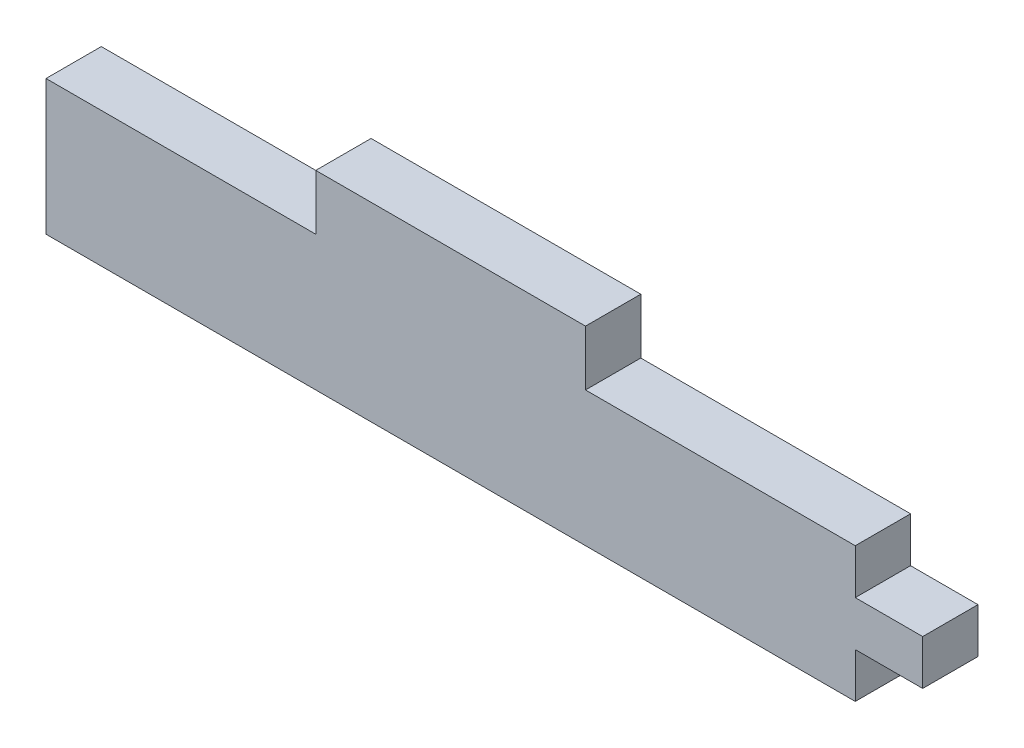
ISO-10303-21;
HEADER;
FILE_DESCRIPTION(('STEP AP214'),'2;1');
FILE_NAME('part.step','',(''),(''),'','','');
FILE_SCHEMA(('AUTOMOTIVE_DESIGN { 1 0 10303 214 1 1 1 1 }'));
ENDSEC;
DATA;
#1=APPLICATION_CONTEXT('core data for automotive mechanical design processes');
#2=APPLICATION_PROTOCOL_DEFINITION('international standard','automotive_design',2000,#1);
#3=PRODUCT_CONTEXT('',#1,'mechanical');
#4=PRODUCT('Part','Part','',(#3));
#5=PRODUCT_RELATED_PRODUCT_CATEGORY('part','',(#4));
#6=PRODUCT_DEFINITION_FORMATION('','',#4);
#7=PRODUCT_DEFINITION_CONTEXT('part definition',#1,'design');
#8=PRODUCT_DEFINITION('design','',#6,#7);
#9=PRODUCT_DEFINITION_SHAPE('','',#8);
#10=(LENGTH_UNIT() NAMED_UNIT(*) SI_UNIT(.MILLI.,.METRE.));
#11=(NAMED_UNIT(*) PLANE_ANGLE_UNIT() SI_UNIT($,.RADIAN.));
#12=(NAMED_UNIT(*) SI_UNIT($,.STERADIAN.) SOLID_ANGLE_UNIT());
#13=UNCERTAINTY_MEASURE_WITH_UNIT(LENGTH_MEASURE(1.E-05),#10,'distance_accuracy_value','');
#14=(GEOMETRIC_REPRESENTATION_CONTEXT(3) GLOBAL_UNCERTAINTY_ASSIGNED_CONTEXT((#13)) GLOBAL_UNIT_ASSIGNED_CONTEXT((#10,
#11,#12)) REPRESENTATION_CONTEXT('',''));
#15=CARTESIAN_POINT('',(0.,0.,0.));
#16=DIRECTION('',(0.,0.,1.));
#17=DIRECTION('',(1.,0.,0.));
#18=AXIS2_PLACEMENT_3D('',#15,#16,#17);
#19=CARTESIAN_POINT('',(25.4,12.7,5.207));
#20=DIRECTION('',(-1.,0.,0.));
#21=DIRECTION('',(0.,-1.,0.));
#22=AXIS2_PLACEMENT_3D('',#19,#20,#21);
#23=PLANE('',#22);
#24=DIRECTION('',(0.,1.,0.));
#25=VECTOR('',#24,1.);
#26=CARTESIAN_POINT('',(25.4,12.7,0.));
#27=LINE('',#26,#25);
#28=CARTESIAN_POINT('',(25.4,12.7,0.));
#29=VERTEX_POINT('',#28);
#30=CARTESIAN_POINT('',(25.4,17.907,0.));
#31=VERTEX_POINT('',#30);
#32=EDGE_CURVE('E153',#29,#31,#27,.T.);
#33=ORIENTED_EDGE('',*,*,#32,.F.);
#34=DIRECTION('',(0.,0.,-1.));
#35=VECTOR('',#34,1.);
#36=CARTESIAN_POINT('',(25.4,12.7,5.207));
#37=LINE('',#36,#35);
#38=CARTESIAN_POINT('',(25.4,12.7,5.207));
#39=VERTEX_POINT('',#38);
#40=EDGE_CURVE('E11',#39,#29,#37,.T.);
#41=ORIENTED_EDGE('',*,*,#40,.F.);
#42=DIRECTION('',(0.,1.,0.));
#43=VECTOR('',#42,1.);
#44=CARTESIAN_POINT('',(25.4,12.7,5.207));
#45=LINE('',#44,#43);
#46=CARTESIAN_POINT('',(25.4,17.907,5.207));
#47=VERTEX_POINT('',#46);
#48=EDGE_CURVE('E184',#39,#47,#45,.T.);
#49=ORIENTED_EDGE('',*,*,#48,.T.);
#50=DIRECTION('',(0.,0.,-1.));
#51=VECTOR('',#50,1.);
#52=CARTESIAN_POINT('',(25.4,17.907,5.207));
#53=LINE('',#52,#51);
#54=EDGE_CURVE('E38',#47,#31,#53,.T.);
#55=ORIENTED_EDGE('',*,*,#54,.T.);
#56=EDGE_LOOP('',(#33,#41,#49,#55));
#57=FACE_BOUND('',#56,.T.);
#58=ADVANCED_FACE('F35',(#57),#23,.T.);
#59=CARTESIAN_POINT('',(0.,12.7,5.207));
#60=DIRECTION('',(0.,1.,0.));
#61=DIRECTION('',(0.,0.,1.));
#62=AXIS2_PLACEMENT_3D('',#59,#60,#61);
#63=PLANE('',#62);
#64=DIRECTION('',(1.,0.,0.));
#65=VECTOR('',#64,1.);
#66=CARTESIAN_POINT('',(0.,12.7,0.));
#67=LINE('',#66,#65);
#68=CARTESIAN_POINT('',(0.,12.7,0.));
#69=VERTEX_POINT('',#68);
#70=EDGE_CURVE('E182',#69,#29,#67,.T.);
#71=ORIENTED_EDGE('',*,*,#70,.F.);
#72=DIRECTION('',(0.,0.,-1.));
#73=VECTOR('',#72,1.);
#74=CARTESIAN_POINT('',(0.,12.7,5.207));
#75=LINE('',#74,#73);
#76=CARTESIAN_POINT('',(0.,12.7,5.207));
#77=VERTEX_POINT('',#76);
#78=EDGE_CURVE('E44',#77,#69,#75,.T.);
#79=ORIENTED_EDGE('',*,*,#78,.F.);
#80=DIRECTION('',(1.,0.,0.));
#81=VECTOR('',#80,1.);
#82=CARTESIAN_POINT('',(0.,12.7,5.207));
#83=LINE('',#82,#81);
#84=EDGE_CURVE('E148',#77,#39,#83,.T.);
#85=ORIENTED_EDGE('',*,*,#84,.T.);
#86=ORIENTED_EDGE('',*,*,#40,.T.);
#87=EDGE_LOOP('',(#71,#79,#85,#86));
#88=FACE_BOUND('',#87,.T.);
#89=ADVANCED_FACE('F206',(#88),#63,.T.);
#90=CARTESIAN_POINT('',(0.,0.,5.207));
#91=DIRECTION('',(-1.,0.,0.));
#92=DIRECTION('',(0.,0.,1.));
#93=AXIS2_PLACEMENT_3D('',#90,#91,#92);
#94=PLANE('',#93);
#95=DIRECTION('',(0.,1.,0.));
#96=VECTOR('',#95,1.);
#97=CARTESIAN_POINT('',(0.,0.,0.));
#98=LINE('',#97,#96);
#99=CARTESIAN_POINT('',(0.,0.,0.));
#100=VERTEX_POINT('',#99);
#101=EDGE_CURVE('E134',#100,#69,#98,.T.);
#102=ORIENTED_EDGE('',*,*,#101,.F.);
#103=DIRECTION('',(0.,0.,-1.));
#104=VECTOR('',#103,1.);
#105=CARTESIAN_POINT('',(0.,0.,5.207));
#106=LINE('',#105,#104);
#107=CARTESIAN_POINT('',(0.,0.,5.207));
#108=VERTEX_POINT('',#107);
#109=EDGE_CURVE('E128',#108,#100,#106,.T.);
#110=ORIENTED_EDGE('',*,*,#109,.F.);
#111=DIRECTION('',(0.,1.,0.));
#112=VECTOR('',#111,1.);
#113=CARTESIAN_POINT('',(0.,0.,5.207));
#114=LINE('',#113,#112);
#115=EDGE_CURVE('E132',#108,#77,#114,.T.);
#116=ORIENTED_EDGE('',*,*,#115,.T.);
#117=ORIENTED_EDGE('',*,*,#78,.T.);
#118=EDGE_LOOP('',(#102,#110,#116,#117));
#119=FACE_BOUND('',#118,.T.);
#120=ADVANCED_FACE('F130',(#119),#94,.T.);
#121=CARTESIAN_POINT('',(0.,0.,5.207));
#122=DIRECTION('',(0.,1.,0.));
#123=DIRECTION('',(0.,0.,1.));
#124=AXIS2_PLACEMENT_3D('',#121,#122,#123);
#125=PLANE('',#124);
#126=DIRECTION('',(1.,0.,0.));
#127=VECTOR('',#126,1.);
#128=CARTESIAN_POINT('',(0.,0.,0.));
#129=LINE('',#128,#127);
#130=CARTESIAN_POINT('',(76.2,0.,0.));
#131=VERTEX_POINT('',#130);
#132=EDGE_CURVE('E179',#100,#131,#129,.T.);
#133=ORIENTED_EDGE('',*,*,#132,.T.);
#134=DIRECTION('',(0.,0.,-1.));
#135=VECTOR('',#134,1.);
#136=CARTESIAN_POINT('',(76.2,0.,5.207));
#137=LINE('',#136,#135);
#138=CARTESIAN_POINT('',(76.2,0.,5.207));
#139=VERTEX_POINT('',#138);
#140=EDGE_CURVE('E137',#139,#131,#137,.T.);
#141=ORIENTED_EDGE('',*,*,#140,.F.);
#142=DIRECTION('',(1.,0.,0.));
#143=VECTOR('',#142,1.);
#144=CARTESIAN_POINT('',(0.,0.,5.207));
#145=LINE('',#144,#143);
#146=EDGE_CURVE('E140',#108,#139,#145,.T.);
#147=ORIENTED_EDGE('',*,*,#146,.F.);
#148=ORIENTED_EDGE('',*,*,#109,.T.);
#149=EDGE_LOOP('',(#133,#141,#147,#148));
#150=FACE_BOUND('',#149,.T.);
#151=ADVANCED_FACE('F141',(#150),#125,.F.);
#152=CARTESIAN_POINT('',(76.2,0.,5.207));
#153=DIRECTION('',(-1.,0.,0.));
#154=DIRECTION('',(0.,0.,1.));
#155=AXIS2_PLACEMENT_3D('',#152,#153,#154);
#156=PLANE('',#155);
#157=DIRECTION('',(0.,1.,0.));
#158=VECTOR('',#157,1.);
#159=CARTESIAN_POINT('',(76.2,0.,0.));
#160=LINE('',#159,#158);
#161=CARTESIAN_POINT('',(76.2,4.23333333333333,0.));
#162=VERTEX_POINT('',#161);
#163=EDGE_CURVE('E177',#131,#162,#160,.T.);
#164=ORIENTED_EDGE('',*,*,#163,.T.);
#165=DIRECTION('',(0.,0.,-1.));
#166=VECTOR('',#165,1.);
#167=CARTESIAN_POINT('',(76.2,4.23333333333333,5.207));
#168=LINE('',#167,#166);
#169=CARTESIAN_POINT('',(76.2,4.23333333333333,5.207));
#170=VERTEX_POINT('',#169);
#171=EDGE_CURVE('E188',#170,#162,#168,.T.);
#172=ORIENTED_EDGE('',*,*,#171,.F.);
#173=DIRECTION('',(0.,1.,0.));
#174=VECTOR('',#173,1.);
#175=CARTESIAN_POINT('',(76.2,0.,5.207));
#176=LINE('',#175,#174);
#177=EDGE_CURVE('E145',#139,#170,#176,.T.);
#178=ORIENTED_EDGE('',*,*,#177,.F.);
#179=ORIENTED_EDGE('',*,*,#140,.T.);
#180=EDGE_LOOP('',(#164,#172,#178,#179));
#181=FACE_BOUND('',#180,.T.);
#182=ADVANCED_FACE('F219',(#181),#156,.F.);
#183=CARTESIAN_POINT('',(76.2,4.23333333333333,5.207));
#184=DIRECTION('',(0.,1.,0.));
#185=DIRECTION('',(-1.,0.,0.));
#186=AXIS2_PLACEMENT_3D('',#183,#184,#185);
#187=PLANE('',#186);
#188=DIRECTION('',(1.,0.,0.));
#189=VECTOR('',#188,1.);
#190=CARTESIAN_POINT('',(76.2,4.23333333333333,0.));
#191=LINE('',#190,#189);
#192=CARTESIAN_POINT('',(82.55,4.23333333333333,0.));
#193=VERTEX_POINT('',#192);
#194=EDGE_CURVE('E174',#162,#193,#191,.T.);
#195=ORIENTED_EDGE('',*,*,#194,.T.);
#196=DIRECTION('',(0.,0.,-1.));
#197=VECTOR('',#196,1.);
#198=CARTESIAN_POINT('',(82.55,4.23333333333333,5.207));
#199=LINE('',#198,#197);
#200=CARTESIAN_POINT('',(82.55,4.23333333333333,5.207));
#201=VERTEX_POINT('',#200);
#202=EDGE_CURVE('E191',#201,#193,#199,.T.);
#203=ORIENTED_EDGE('',*,*,#202,.F.);
#204=DIRECTION('',(1.,0.,0.));
#205=VECTOR('',#204,1.);
#206=CARTESIAN_POINT('',(76.2,4.23333333333333,5.207));
#207=LINE('',#206,#205);
#208=EDGE_CURVE('E351',#170,#201,#207,.T.);
#209=ORIENTED_EDGE('',*,*,#208,.F.);
#210=ORIENTED_EDGE('',*,*,#171,.T.);
#211=EDGE_LOOP('',(#195,#203,#209,#210));
#212=FACE_BOUND('',#211,.T.);
#213=ADVANCED_FACE('F222',(#212),#187,.F.);
#214=CARTESIAN_POINT('',(82.55,8.46666666666667,5.207));
#215=DIRECTION('',(1.,0.,0.));
#216=DIRECTION('',(0.,0.,-1.));
#217=AXIS2_PLACEMENT_3D('',#214,#215,#216);
#218=PLANE('',#217);
#219=DIRECTION('',(0.,-1.,0.));
#220=VECTOR('',#219,1.);
#221=CARTESIAN_POINT('',(82.55,8.46666666666667,0.));
#222=LINE('',#221,#220);
#223=CARTESIAN_POINT('',(82.55,8.46666666666667,0.));
#224=VERTEX_POINT('',#223);
#225=EDGE_CURVE('E171',#224,#193,#222,.T.);
#226=ORIENTED_EDGE('',*,*,#225,.F.);
#227=DIRECTION('',(0.,0.,-1.));
#228=VECTOR('',#227,1.);
#229=CARTESIAN_POINT('',(82.55,8.46666666666667,5.207));
#230=LINE('',#229,#228);
#231=CARTESIAN_POINT('',(82.55,8.46666666666667,5.207));
#232=VERTEX_POINT('',#231);
#233=EDGE_CURVE('E193',#232,#224,#230,.T.);
#234=ORIENTED_EDGE('',*,*,#233,.F.);
#235=DIRECTION('',(0.,-1.,0.));
#236=VECTOR('',#235,1.);
#237=CARTESIAN_POINT('',(82.55,8.46666666666667,5.207));
#238=LINE('',#237,#236);
#239=EDGE_CURVE('E352',#232,#201,#238,.T.);
#240=ORIENTED_EDGE('',*,*,#239,.T.);
#241=ORIENTED_EDGE('',*,*,#202,.T.);
#242=EDGE_LOOP('',(#226,#234,#240,#241));
#243=FACE_BOUND('',#242,.T.);
#244=ADVANCED_FACE('F226',(#243),#218,.T.);
#245=CARTESIAN_POINT('',(76.2,8.46666666666667,5.207));
#246=DIRECTION('',(0.,1.,0.));
#247=DIRECTION('',(-1.,0.,0.));
#248=AXIS2_PLACEMENT_3D('',#245,#246,#247);
#249=PLANE('',#248);
#250=DIRECTION('',(1.,0.,0.));
#251=VECTOR('',#250,1.);
#252=CARTESIAN_POINT('',(76.2,8.46666666666667,0.));
#253=LINE('',#252,#251);
#254=CARTESIAN_POINT('',(76.2,8.46666666666667,0.));
#255=VERTEX_POINT('',#254);
#256=EDGE_CURVE('E168',#255,#224,#253,.T.);
#257=ORIENTED_EDGE('',*,*,#256,.F.);
#258=DIRECTION('',(0.,0.,-1.));
#259=VECTOR('',#258,1.);
#260=CARTESIAN_POINT('',(76.2,8.46666666666667,5.207));
#261=LINE('',#260,#259);
#262=CARTESIAN_POINT('',(76.2,8.46666666666667,5.207));
#263=VERTEX_POINT('',#262);
#264=EDGE_CURVE('E195',#263,#255,#261,.T.);
#265=ORIENTED_EDGE('',*,*,#264,.F.);
#266=DIRECTION('',(1.,0.,0.));
#267=VECTOR('',#266,1.);
#268=CARTESIAN_POINT('',(76.2,8.46666666666667,5.207));
#269=LINE('',#268,#267);
#270=EDGE_CURVE('E343',#263,#232,#269,.T.);
#271=ORIENTED_EDGE('',*,*,#270,.T.);
#272=ORIENTED_EDGE('',*,*,#233,.T.);
#273=EDGE_LOOP('',(#257,#265,#271,#272));
#274=FACE_BOUND('',#273,.T.);
#275=ADVANCED_FACE('F230',(#274),#249,.T.);
#276=CARTESIAN_POINT('',(76.2,8.46666666666667,5.207));
#277=DIRECTION('',(-1.,0.,0.));
#278=DIRECTION('',(0.,0.,1.));
#279=AXIS2_PLACEMENT_3D('',#276,#277,#278);
#280=PLANE('',#279);
#281=DIRECTION('',(0.,1.,0.));
#282=VECTOR('',#281,1.);
#283=CARTESIAN_POINT('',(76.2,8.46666666666667,0.));
#284=LINE('',#283,#282);
#285=CARTESIAN_POINT('',(76.2,12.7,0.));
#286=VERTEX_POINT('',#285);
#287=EDGE_CURVE('E165',#255,#286,#284,.T.);
#288=ORIENTED_EDGE('',*,*,#287,.T.);
#289=DIRECTION('',(0.,0.,-1.));
#290=VECTOR('',#289,1.);
#291=CARTESIAN_POINT('',(76.2,12.7,5.207));
#292=LINE('',#291,#290);
#293=CARTESIAN_POINT('',(76.2,12.7,5.207));
#294=VERTEX_POINT('',#293);
#295=EDGE_CURVE('E197',#294,#286,#292,.T.);
#296=ORIENTED_EDGE('',*,*,#295,.F.);
#297=DIRECTION('',(0.,1.,0.));
#298=VECTOR('',#297,1.);
#299=CARTESIAN_POINT('',(76.2,8.46666666666667,5.207));
#300=LINE('',#299,#298);
#301=EDGE_CURVE('E357',#263,#294,#300,.T.);
#302=ORIENTED_EDGE('',*,*,#301,.F.);
#303=ORIENTED_EDGE('',*,*,#264,.T.);
#304=EDGE_LOOP('',(#288,#296,#302,#303));
#305=FACE_BOUND('',#304,.T.);
#306=ADVANCED_FACE('F234',(#305),#280,.F.);
#307=CARTESIAN_POINT('',(50.8,12.7,5.207));
#308=DIRECTION('',(0.,1.,0.));
#309=DIRECTION('',(0.,0.,1.));
#310=AXIS2_PLACEMENT_3D('',#307,#308,#309);
#311=PLANE('',#310);
#312=DIRECTION('',(1.,0.,0.));
#313=VECTOR('',#312,1.);
#314=CARTESIAN_POINT('',(50.8,12.7,0.));
#315=LINE('',#314,#313);
#316=CARTESIAN_POINT('',(50.8,12.7,0.));
#317=VERTEX_POINT('',#316);
#318=EDGE_CURVE('E162',#317,#286,#315,.T.);
#319=ORIENTED_EDGE('',*,*,#318,.F.);
#320=DIRECTION('',(0.,0.,-1.));
#321=VECTOR('',#320,1.);
#322=CARTESIAN_POINT('',(50.8,12.7,5.207));
#323=LINE('',#322,#321);
#324=CARTESIAN_POINT('',(50.8,12.7,5.207));
#325=VERTEX_POINT('',#324);
#326=EDGE_CURVE('E199',#325,#317,#323,.T.);
#327=ORIENTED_EDGE('',*,*,#326,.F.);
#328=DIRECTION('',(1.,0.,0.));
#329=VECTOR('',#328,1.);
#330=CARTESIAN_POINT('',(50.8,12.7,5.207));
#331=LINE('',#330,#329);
#332=EDGE_CURVE('E337',#325,#294,#331,.T.);
#333=ORIENTED_EDGE('',*,*,#332,.T.);
#334=ORIENTED_EDGE('',*,*,#295,.T.);
#335=EDGE_LOOP('',(#319,#327,#333,#334));
#336=FACE_BOUND('',#335,.T.);
#337=ADVANCED_FACE('F238',(#336),#311,.T.);
#338=CARTESIAN_POINT('',(50.8,12.7,5.207));
#339=DIRECTION('',(-1.,0.,0.));
#340=DIRECTION('',(0.,0.,1.));
#341=AXIS2_PLACEMENT_3D('',#338,#339,#340);
#342=PLANE('',#341);
#343=DIRECTION('',(0.,1.,0.));
#344=VECTOR('',#343,1.);
#345=CARTESIAN_POINT('',(50.8,12.7,0.));
#346=LINE('',#345,#344);
#347=CARTESIAN_POINT('',(50.8,17.907,0.));
#348=VERTEX_POINT('',#347);
#349=EDGE_CURVE('E159',#317,#348,#346,.T.);
#350=ORIENTED_EDGE('',*,*,#349,.T.);
#351=DIRECTION('',(0.,0.,-1.));
#352=VECTOR('',#351,1.);
#353=CARTESIAN_POINT('',(50.8,17.907,5.207));
#354=LINE('',#353,#352);
#355=CARTESIAN_POINT('',(50.8,17.907,5.207));
#356=VERTEX_POINT('',#355);
#357=EDGE_CURVE('E200',#356,#348,#354,.T.);
#358=ORIENTED_EDGE('',*,*,#357,.F.);
#359=DIRECTION('',(0.,1.,0.));
#360=VECTOR('',#359,1.);
#361=CARTESIAN_POINT('',(50.8,12.7,5.207));
#362=LINE('',#361,#360);
#363=EDGE_CURVE('E360',#325,#356,#362,.T.);
#364=ORIENTED_EDGE('',*,*,#363,.F.);
#365=ORIENTED_EDGE('',*,*,#326,.T.);
#366=EDGE_LOOP('',(#350,#358,#364,#365));
#367=FACE_BOUND('',#366,.T.);
#368=ADVANCED_FACE('F242',(#367),#342,.F.);
#369=CARTESIAN_POINT('',(25.4,17.907,5.207));
#370=DIRECTION('',(0.,1.,0.));
#371=DIRECTION('',(0.,0.,1.));
#372=AXIS2_PLACEMENT_3D('',#369,#370,#371);
#373=PLANE('',#372);
#374=DIRECTION('',(1.,0.,0.));
#375=VECTOR('',#374,1.);
#376=CARTESIAN_POINT('',(25.4,17.907,0.));
#377=LINE('',#376,#375);
#378=EDGE_CURVE('E156',#31,#348,#377,.T.);
#379=ORIENTED_EDGE('',*,*,#378,.F.);
#380=ORIENTED_EDGE('',*,*,#54,.F.);
#381=DIRECTION('',(1.,0.,0.));
#382=VECTOR('',#381,1.);
#383=CARTESIAN_POINT('',(25.4,17.907,5.207));
#384=LINE('',#383,#382);
#385=EDGE_CURVE('E362',#47,#356,#384,.T.);
#386=ORIENTED_EDGE('',*,*,#385,.T.);
#387=ORIENTED_EDGE('',*,*,#357,.T.);
#388=EDGE_LOOP('',(#379,#380,#386,#387));
#389=FACE_BOUND('',#388,.T.);
#390=ADVANCED_FACE('F202',(#389),#373,.T.);
#391=CARTESIAN_POINT('',(0.,0.,5.207));
#392=DIRECTION('',(0.,0.,-1.));
#393=DIRECTION('',(-1.,0.,0.));
#394=AXIS2_PLACEMENT_3D('',#391,#392,#393);
#395=PLANE('',#394);
#396=ORIENTED_EDGE('',*,*,#48,.F.);
#397=ORIENTED_EDGE('',*,*,#84,.F.);
#398=ORIENTED_EDGE('',*,*,#115,.F.);
#399=ORIENTED_EDGE('',*,*,#146,.T.);
#400=ORIENTED_EDGE('',*,*,#177,.T.);
#401=ORIENTED_EDGE('',*,*,#208,.T.);
#402=ORIENTED_EDGE('',*,*,#239,.F.);
#403=ORIENTED_EDGE('',*,*,#270,.F.);
#404=ORIENTED_EDGE('',*,*,#301,.T.);
#405=ORIENTED_EDGE('',*,*,#332,.F.);
#406=ORIENTED_EDGE('',*,*,#363,.T.);
#407=ORIENTED_EDGE('',*,*,#385,.F.);
#408=EDGE_LOOP('',(#396,#397,#398,#399,#400,#401,#402,#403,#404,#405,#406,#407));
#409=FACE_BOUND('',#408,.T.);
#410=ADVANCED_FACE('F147',(#409),#395,.F.);
#411=CARTESIAN_POINT('',(0.,0.,0.));
#412=DIRECTION('',(0.,0.,-1.));
#413=DIRECTION('',(-1.,0.,0.));
#414=AXIS2_PLACEMENT_3D('',#411,#412,#413);
#415=PLANE('',#414);
#416=ORIENTED_EDGE('',*,*,#32,.T.);
#417=ORIENTED_EDGE('',*,*,#378,.T.);
#418=ORIENTED_EDGE('',*,*,#349,.F.);
#419=ORIENTED_EDGE('',*,*,#318,.T.);
#420=ORIENTED_EDGE('',*,*,#287,.F.);
#421=ORIENTED_EDGE('',*,*,#256,.T.);
#422=ORIENTED_EDGE('',*,*,#225,.T.);
#423=ORIENTED_EDGE('',*,*,#194,.F.);
#424=ORIENTED_EDGE('',*,*,#163,.F.);
#425=ORIENTED_EDGE('',*,*,#132,.F.);
#426=ORIENTED_EDGE('',*,*,#101,.T.);
#427=ORIENTED_EDGE('',*,*,#70,.T.);
#428=EDGE_LOOP('',(#416,#417,#418,#419,#420,#421,#422,#423,#424,#425,#426,#427));
#429=FACE_BOUND('',#428,.T.);
#430=ADVANCED_FACE('F205',(#429),#415,.T.);
#431=CLOSED_SHELL('',(#58,#89,#120,#151,#182,#213,#244,#275,#306,#337,#368,#390,#410,#430));
#432=MANIFOLD_SOLID_BREP('B2',#431);
#433=ADVANCED_BREP_SHAPE_REPRESENTATION('',(#18,#432),#14);
#434=SHAPE_DEFINITION_REPRESENTATION(#9,#433);
ENDSEC;
END-ISO-10303-21;
